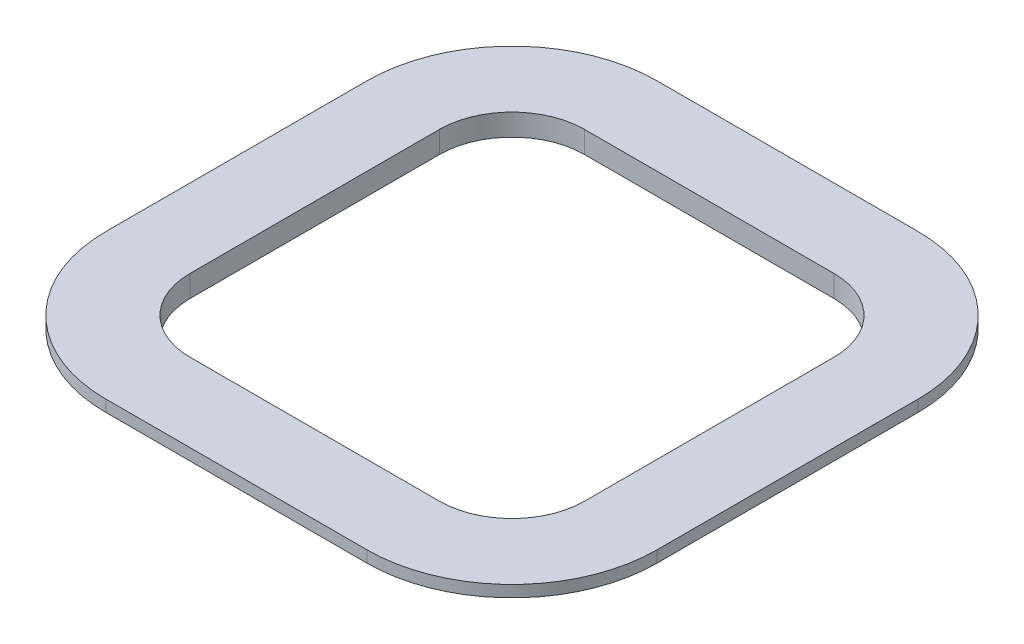
ISO-10303-21;
HEADER;
FILE_DESCRIPTION(('STEP AP214'),'2;1');
FILE_NAME('part.step','',(''),(''),'','','');
FILE_SCHEMA(('AUTOMOTIVE_DESIGN { 1 0 10303 214 1 1 1 1 }'));
ENDSEC;
DATA;
#1=APPLICATION_CONTEXT('core data for automotive mechanical design processes');
#2=APPLICATION_PROTOCOL_DEFINITION('international standard','automotive_design',2000,#1);
#3=PRODUCT_CONTEXT('',#1,'mechanical');
#4=PRODUCT('Part','Part','',(#3));
#5=PRODUCT_RELATED_PRODUCT_CATEGORY('part','',(#4));
#6=PRODUCT_DEFINITION_FORMATION('','',#4);
#7=PRODUCT_DEFINITION_CONTEXT('part definition',#1,'design');
#8=PRODUCT_DEFINITION('design','',#6,#7);
#9=PRODUCT_DEFINITION_SHAPE('','',#8);
#10=(LENGTH_UNIT() NAMED_UNIT(*) SI_UNIT(.MILLI.,.METRE.));
#11=(NAMED_UNIT(*) PLANE_ANGLE_UNIT() SI_UNIT($,.RADIAN.));
#12=(NAMED_UNIT(*) SI_UNIT($,.STERADIAN.) SOLID_ANGLE_UNIT());
#13=UNCERTAINTY_MEASURE_WITH_UNIT(LENGTH_MEASURE(1.E-05),#10,'distance_accuracy_value','');
#14=(GEOMETRIC_REPRESENTATION_CONTEXT(3) GLOBAL_UNCERTAINTY_ASSIGNED_CONTEXT((#13)) GLOBAL_UNIT_ASSIGNED_CONTEXT((#10,
#11,#12)) REPRESENTATION_CONTEXT('',''));
#15=CARTESIAN_POINT('',(0.,0.,0.));
#16=DIRECTION('',(0.,0.,1.));
#17=DIRECTION('',(1.,0.,0.));
#18=AXIS2_PLACEMENT_3D('',#15,#16,#17);
#19=CARTESIAN_POINT('',(-19.,-1.5,-19.));
#20=DIRECTION('',(-1.,0.,0.));
#21=DIRECTION('',(0.,0.,1.));
#22=AXIS2_PLACEMENT_3D('',#19,#20,#21);
#23=PLANE('',#22);
#24=DIRECTION('',(0.,1.,0.));
#25=VECTOR('',#24,1.);
#26=CARTESIAN_POINT('',(-19.,-1.5,-8.99999999999999));
#27=LINE('',#26,#25);
#28=CARTESIAN_POINT('',(-19.,0.,-8.99999999999999));
#29=VERTEX_POINT('',#28);
#30=CARTESIAN_POINT('',(-19.,-0.8,-8.99999999999999));
#31=VERTEX_POINT('',#30);
#32=EDGE_CURVE('E11',#29,#31,#27,.F.);
#33=ORIENTED_EDGE('',*,*,#32,.T.);
#34=DIRECTION('',(0.,0.,1.));
#35=VECTOR('',#34,1.);
#36=CARTESIAN_POINT('',(-19.,-0.8,-8.99999999999999));
#37=LINE('',#36,#35);
#38=CARTESIAN_POINT('',(-19.,-0.8,9.));
#39=VERTEX_POINT('',#38);
#40=EDGE_CURVE('E222',#31,#39,#37,.T.);
#41=ORIENTED_EDGE('',*,*,#40,.T.);
#42=DIRECTION('',(0.,1.,0.));
#43=VECTOR('',#42,1.);
#44=CARTESIAN_POINT('',(-19.,-1.5,9.00000000000001));
#45=LINE('',#44,#43);
#46=CARTESIAN_POINT('',(-19.,0.,9.00000000000001));
#47=VERTEX_POINT('',#46);
#48=EDGE_CURVE('E40',#39,#47,#45,.T.);
#49=ORIENTED_EDGE('',*,*,#48,.T.);
#50=DIRECTION('',(0.,0.,1.));
#51=VECTOR('',#50,1.);
#52=CARTESIAN_POINT('',(-19.,0.,-19.));
#53=LINE('',#52,#51);
#54=EDGE_CURVE('E265',#29,#47,#53,.T.);
#55=ORIENTED_EDGE('',*,*,#54,.F.);
#56=EDGE_LOOP('',(#33,#41,#49,#55));
#57=FACE_BOUND('',#56,.T.);
#58=ADVANCED_FACE('F32',(#57),#23,.T.);
#59=CARTESIAN_POINT('',(-19.,-1.5,-19.));
#60=DIRECTION('',(0.,0.,-1.));
#61=DIRECTION('',(-1.,0.,0.));
#62=AXIS2_PLACEMENT_3D('',#59,#60,#61);
#63=PLANE('',#62);
#64=DIRECTION('',(0.,1.,0.));
#65=VECTOR('',#64,1.);
#66=CARTESIAN_POINT('',(8.99999999999999,-1.5,-19.));
#67=LINE('',#66,#65);
#68=CARTESIAN_POINT('',(8.99999999999999,0.,-19.));
#69=VERTEX_POINT('',#68);
#70=CARTESIAN_POINT('',(8.99999999999999,-0.8,-19.));
#71=VERTEX_POINT('',#70);
#72=EDGE_CURVE('E348',#69,#71,#67,.F.);
#73=ORIENTED_EDGE('',*,*,#72,.T.);
#74=DIRECTION('',(-1.,0.,0.));
#75=VECTOR('',#74,1.);
#76=CARTESIAN_POINT('',(8.99999999999999,-0.8,-19.));
#77=LINE('',#76,#75);
#78=CARTESIAN_POINT('',(-9.00000000000001,-0.8,-19.));
#79=VERTEX_POINT('',#78);
#80=EDGE_CURVE('E206',#71,#79,#77,.T.);
#81=ORIENTED_EDGE('',*,*,#80,.T.);
#82=DIRECTION('',(0.,1.,0.));
#83=VECTOR('',#82,1.);
#84=CARTESIAN_POINT('',(-9.00000000000001,-1.5,-19.));
#85=LINE('',#84,#83);
#86=CARTESIAN_POINT('',(-9.00000000000001,0.,-19.));
#87=VERTEX_POINT('',#86);
#88=EDGE_CURVE('E55',#79,#87,#85,.T.);
#89=ORIENTED_EDGE('',*,*,#88,.T.);
#90=DIRECTION('',(-1.,0.,0.));
#91=VECTOR('',#90,1.);
#92=CARTESIAN_POINT('',(-19.,0.,-19.));
#93=LINE('',#92,#91);
#94=EDGE_CURVE('E284',#69,#87,#93,.T.);
#95=ORIENTED_EDGE('',*,*,#94,.F.);
#96=EDGE_LOOP('',(#73,#81,#89,#95));
#97=FACE_BOUND('',#96,.T.);
#98=ADVANCED_FACE('F370',(#97),#63,.T.);
#99=CARTESIAN_POINT('',(-19.,-1.5,19.));
#100=DIRECTION('',(0.,0.,1.));
#101=DIRECTION('',(1.,0.,0.));
#102=AXIS2_PLACEMENT_3D('',#99,#100,#101);
#103=PLANE('',#102);
#104=DIRECTION('',(0.,1.,0.));
#105=VECTOR('',#104,1.);
#106=CARTESIAN_POINT('',(-9.00000000000001,-1.5,19.));
#107=LINE('',#106,#105);
#108=CARTESIAN_POINT('',(-9.00000000000001,0.,19.));
#109=VERTEX_POINT('',#108);
#110=CARTESIAN_POINT('',(-9.00000000000001,-0.8,19.));
#111=VERTEX_POINT('',#110);
#112=EDGE_CURVE('E329',#109,#111,#107,.F.);
#113=ORIENTED_EDGE('',*,*,#112,.T.);
#114=DIRECTION('',(1.,0.,0.));
#115=VECTOR('',#114,1.);
#116=CARTESIAN_POINT('',(-9.00000000000001,-0.8,19.));
#117=LINE('',#116,#115);
#118=CARTESIAN_POINT('',(9.,-0.8,19.));
#119=VERTEX_POINT('',#118);
#120=EDGE_CURVE('E237',#111,#119,#117,.T.);
#121=ORIENTED_EDGE('',*,*,#120,.T.);
#122=DIRECTION('',(0.,1.,0.));
#123=VECTOR('',#122,1.);
#124=CARTESIAN_POINT('',(9.,-1.5,19.));
#125=LINE('',#124,#123);
#126=CARTESIAN_POINT('',(9.,0.,19.));
#127=VERTEX_POINT('',#126);
#128=EDGE_CURVE('E332',#119,#127,#125,.T.);
#129=ORIENTED_EDGE('',*,*,#128,.T.);
#130=DIRECTION('',(1.,0.,0.));
#131=VECTOR('',#130,1.);
#132=CARTESIAN_POINT('',(-19.,0.,19.));
#133=LINE('',#132,#131);
#134=EDGE_CURVE('E278',#109,#127,#133,.T.);
#135=ORIENTED_EDGE('',*,*,#134,.F.);
#136=EDGE_LOOP('',(#113,#121,#129,#135));
#137=FACE_BOUND('',#136,.T.);
#138=ADVANCED_FACE('F390',(#137),#103,.T.);
#139=CARTESIAN_POINT('',(-19.,-1.5,19.));
#140=DIRECTION('',(0.,1.,0.));
#141=DIRECTION('',(0.,0.,1.));
#142=AXIS2_PLACEMENT_3D('',#139,#140,#141);
#143=PLANE('',#142);
#144=DIRECTION('',(1.,0.,0.));
#145=VECTOR('',#144,1.);
#146=CARTESIAN_POINT('',(-9.00000000000001,-1.5,13.6));
#147=LINE('',#146,#145);
#148=CARTESIAN_POINT('',(-9.00000000000001,-1.5,13.6));
#149=VERTEX_POINT('',#148);
#150=CARTESIAN_POINT('',(-8.6,-1.5,13.6));
#151=VERTEX_POINT('',#150);
#152=EDGE_CURVE('E235',#149,#151,#147,.T.);
#153=ORIENTED_EDGE('',*,*,#152,.F.);
#154=CARTESIAN_POINT('',(-9.00000000000001,-1.5,9.00000000000001));
#155=DIRECTION('',(0.,1.,0.));
#156=DIRECTION('',(0.,0.,1.));
#157=AXIS2_PLACEMENT_3D('',#154,#155,#156);
#158=CIRCLE('',#157,4.6);
#159=CARTESIAN_POINT('',(-13.6,-1.5,9.));
#160=VERTEX_POINT('',#159);
#161=EDGE_CURVE('E226',#160,#149,#158,.T.);
#162=ORIENTED_EDGE('',*,*,#161,.F.);
#163=DIRECTION('',(0.,0.,1.));
#164=VECTOR('',#163,1.);
#165=CARTESIAN_POINT('',(-13.6,-1.5,-9.));
#166=LINE('',#165,#164);
#167=CARTESIAN_POINT('',(-13.6,-1.5,8.6));
#168=VERTEX_POINT('',#167);
#169=EDGE_CURVE('E219',#168,#160,#166,.T.);
#170=ORIENTED_EDGE('',*,*,#169,.F.);
#171=CARTESIAN_POINT('',(-8.6,-1.5,8.6));
#172=DIRECTION('',(0.,1.,0.));
#173=DIRECTION('',(0.,0.,1.));
#174=AXIS2_PLACEMENT_3D('',#171,#172,#173);
#175=CIRCLE('',#174,5.);
#176=EDGE_CURVE('E317',#168,#151,#175,.T.);
#177=ORIENTED_EDGE('',*,*,#176,.T.);
#178=EDGE_LOOP('',(#153,#162,#170,#177));
#179=FACE_BOUND('',#178,.T.);
#180=ADVANCED_FACE('F402',(#179),#143,.F.);
#181=CARTESIAN_POINT('',(-13.6,-1.5,-9.));
#182=VERTEX_POINT('',#181);
#183=CARTESIAN_POINT('',(-13.6,-1.5,-8.6));
#184=VERTEX_POINT('',#183);
#185=EDGE_CURVE('E220',#182,#184,#166,.T.);
#186=ORIENTED_EDGE('',*,*,#185,.F.);
#187=CARTESIAN_POINT('',(-9.00000000000001,-1.5,-8.99999999999999));
#188=DIRECTION('',(0.,1.,0.));
#189=DIRECTION('',(0.,0.,1.));
#190=AXIS2_PLACEMENT_3D('',#187,#188,#189);
#191=CIRCLE('',#190,4.6);
#192=CARTESIAN_POINT('',(-9.,-1.5,-13.6));
#193=VERTEX_POINT('',#192);
#194=EDGE_CURVE('E210',#193,#182,#191,.T.);
#195=ORIENTED_EDGE('',*,*,#194,.F.);
#196=DIRECTION('',(-1.,0.,0.));
#197=VECTOR('',#196,1.);
#198=CARTESIAN_POINT('',(8.99999999999999,-1.5,-13.6));
#199=LINE('',#198,#197);
#200=CARTESIAN_POINT('',(-8.6,-1.5,-13.6));
#201=VERTEX_POINT('',#200);
#202=EDGE_CURVE('E204',#201,#193,#199,.T.);
#203=ORIENTED_EDGE('',*,*,#202,.F.);
#204=CARTESIAN_POINT('',(-8.6,-1.5,-8.6));
#205=DIRECTION('',(0.,1.,0.));
#206=DIRECTION('',(0.,0.,1.));
#207=AXIS2_PLACEMENT_3D('',#204,#205,#206);
#208=CIRCLE('',#207,5.);
#209=EDGE_CURVE('E322',#201,#184,#208,.T.);
#210=ORIENTED_EDGE('',*,*,#209,.T.);
#211=EDGE_LOOP('',(#186,#195,#203,#210));
#212=FACE_BOUND('',#211,.T.);
#213=ADVANCED_FACE('F438',(#212),#143,.F.);
#214=CARTESIAN_POINT('',(8.99999999999999,-1.5,-13.6));
#215=VERTEX_POINT('',#214);
#216=CARTESIAN_POINT('',(8.6,-1.5,-13.6));
#217=VERTEX_POINT('',#216);
#218=EDGE_CURVE('E195',#215,#217,#199,.T.);
#219=ORIENTED_EDGE('',*,*,#218,.F.);
#220=CARTESIAN_POINT('',(8.99999999999999,-1.5,-8.99999999999999));
#221=DIRECTION('',(0.,1.,0.));
#222=DIRECTION('',(0.,0.,1.));
#223=AXIS2_PLACEMENT_3D('',#220,#221,#222);
#224=CIRCLE('',#223,4.60000000000001);
#225=CARTESIAN_POINT('',(13.6,-1.5,-8.99999999999999));
#226=VERTEX_POINT('',#225);
#227=EDGE_CURVE('E189',#226,#215,#224,.T.);
#228=ORIENTED_EDGE('',*,*,#227,.F.);
#229=DIRECTION('',(0.,0.,1.));
#230=VECTOR('',#229,1.);
#231=CARTESIAN_POINT('',(13.6,-1.5,-8.99999999999999));
#232=LINE('',#231,#230);
#233=CARTESIAN_POINT('',(13.6,-1.5,-8.6));
#234=VERTEX_POINT('',#233);
#235=EDGE_CURVE('E171',#226,#234,#232,.T.);
#236=ORIENTED_EDGE('',*,*,#235,.T.);
#237=CARTESIAN_POINT('',(8.6,-1.5,-8.6));
#238=DIRECTION('',(0.,1.,0.));
#239=DIRECTION('',(0.,0.,1.));
#240=AXIS2_PLACEMENT_3D('',#237,#238,#239);
#241=CIRCLE('',#240,5.);
#242=EDGE_CURVE('E327',#234,#217,#241,.T.);
#243=ORIENTED_EDGE('',*,*,#242,.T.);
#244=EDGE_LOOP('',(#219,#228,#236,#243));
#245=FACE_BOUND('',#244,.T.);
#246=ADVANCED_FACE('F194',(#245),#143,.F.);
#247=CARTESIAN_POINT('',(8.6,-1.5,13.6));
#248=VERTEX_POINT('',#247);
#249=CARTESIAN_POINT('',(8.99999999999999,-1.5,13.6));
#250=VERTEX_POINT('',#249);
#251=EDGE_CURVE('E234',#248,#250,#147,.T.);
#252=ORIENTED_EDGE('',*,*,#251,.F.);
#253=CARTESIAN_POINT('',(8.6,-1.5,8.6));
#254=DIRECTION('',(0.,1.,0.));
#255=DIRECTION('',(0.,0.,1.));
#256=AXIS2_PLACEMENT_3D('',#253,#254,#255);
#257=CIRCLE('',#256,5.);
#258=CARTESIAN_POINT('',(13.6,-1.5,8.6));
#259=VERTEX_POINT('',#258);
#260=EDGE_CURVE('E312',#248,#259,#257,.T.);
#261=ORIENTED_EDGE('',*,*,#260,.T.);
#262=CARTESIAN_POINT('',(13.6,-1.5,9.00000000000001));
#263=VERTEX_POINT('',#262);
#264=EDGE_CURVE('E183',#259,#263,#232,.T.);
#265=ORIENTED_EDGE('',*,*,#264,.T.);
#266=CARTESIAN_POINT('',(9.,-1.5,9.));
#267=DIRECTION('',(0.,1.,0.));
#268=DIRECTION('',(0.,0.,1.));
#269=AXIS2_PLACEMENT_3D('',#266,#267,#268);
#270=CIRCLE('',#269,4.6);
#271=EDGE_CURVE('E242',#250,#263,#270,.T.);
#272=ORIENTED_EDGE('',*,*,#271,.F.);
#273=EDGE_LOOP('',(#252,#261,#265,#272));
#274=FACE_BOUND('',#273,.T.);
#275=ADVANCED_FACE('F473',(#274),#143,.F.);
#276=CARTESIAN_POINT('',(9.,-1.5,9.));
#277=DIRECTION('',(0.,1.,0.));
#278=DIRECTION('',(0.,0.,1.));
#279=AXIS2_PLACEMENT_3D('',#276,#277,#278);
#280=CYLINDRICAL_SURFACE('',#279,10.);
#281=ORIENTED_EDGE('',*,*,#128,.F.);
#282=CARTESIAN_POINT('',(9.,-0.8,9.));
#283=DIRECTION('',(0.,1.,0.));
#284=DIRECTION('',(0.,0.,1.));
#285=AXIS2_PLACEMENT_3D('',#282,#283,#284);
#286=CIRCLE('',#285,10.);
#287=CARTESIAN_POINT('',(19.,-0.8,9.));
#288=VERTEX_POINT('',#287);
#289=EDGE_CURVE('E245',#119,#288,#286,.T.);
#290=ORIENTED_EDGE('',*,*,#289,.T.);
#291=DIRECTION('',(0.,1.,0.));
#292=VECTOR('',#291,1.);
#293=CARTESIAN_POINT('',(19.,-1.5,9.));
#294=LINE('',#293,#292);
#295=CARTESIAN_POINT('',(19.,0.,9.));
#296=VERTEX_POINT('',#295);
#297=EDGE_CURVE('E344',#296,#288,#294,.F.);
#298=ORIENTED_EDGE('',*,*,#297,.F.);
#299=CARTESIAN_POINT('',(9.,0.,9.));
#300=DIRECTION('',(0.,1.,0.));
#301=DIRECTION('',(0.,0.,1.));
#302=AXIS2_PLACEMENT_3D('',#299,#300,#301);
#303=CIRCLE('',#302,10.);
#304=EDGE_CURVE('E340',#127,#296,#303,.T.);
#305=ORIENTED_EDGE('',*,*,#304,.F.);
#306=EDGE_LOOP('',(#281,#290,#298,#305));
#307=FACE_BOUND('',#306,.T.);
#308=ADVANCED_FACE('F387',(#307),#280,.T.);
#309=CARTESIAN_POINT('',(8.99999999999999,-1.5,-8.99999999999999));
#310=DIRECTION('',(0.,1.,0.));
#311=DIRECTION('',(0.,0.,1.));
#312=AXIS2_PLACEMENT_3D('',#309,#310,#311);
#313=CYLINDRICAL_SURFACE('',#312,10.);
#314=DIRECTION('',(0.,1.,0.));
#315=VECTOR('',#314,1.);
#316=CARTESIAN_POINT('',(19.,-1.5,-9.));
#317=LINE('',#316,#315);
#318=CARTESIAN_POINT('',(19.,-0.8,-8.99999999999999));
#319=VERTEX_POINT('',#318);
#320=CARTESIAN_POINT('',(19.,0.,-9.));
#321=VERTEX_POINT('',#320);
#322=EDGE_CURVE('E342',#319,#321,#317,.T.);
#323=ORIENTED_EDGE('',*,*,#322,.F.);
#324=CARTESIAN_POINT('',(8.99999999999999,-0.8,-8.99999999999999));
#325=DIRECTION('',(0.,1.,0.));
#326=DIRECTION('',(0.,0.,1.));
#327=AXIS2_PLACEMENT_3D('',#324,#325,#326);
#328=CIRCLE('',#327,10.);
#329=EDGE_CURVE('E192',#319,#71,#328,.T.);
#330=ORIENTED_EDGE('',*,*,#329,.T.);
#331=ORIENTED_EDGE('',*,*,#72,.F.);
#332=CARTESIAN_POINT('',(8.99999999999999,0.,-8.99999999999999));
#333=DIRECTION('',(0.,1.,0.));
#334=DIRECTION('',(0.,0.,1.));
#335=AXIS2_PLACEMENT_3D('',#332,#333,#334);
#336=CIRCLE('',#335,10.);
#337=EDGE_CURVE('E338',#321,#69,#336,.T.);
#338=ORIENTED_EDGE('',*,*,#337,.F.);
#339=EDGE_LOOP('',(#323,#330,#331,#338));
#340=FACE_BOUND('',#339,.T.);
#341=ADVANCED_FACE('F375',(#340),#313,.T.);
#342=CARTESIAN_POINT('',(-9.00000000000001,-1.5,-8.99999999999999));
#343=DIRECTION('',(0.,1.,0.));
#344=DIRECTION('',(0.,0.,1.));
#345=AXIS2_PLACEMENT_3D('',#342,#343,#344);
#346=CYLINDRICAL_SURFACE('',#345,10.);
#347=ORIENTED_EDGE('',*,*,#88,.F.);
#348=CARTESIAN_POINT('',(-9.00000000000001,-0.8,-8.99999999999999));
#349=DIRECTION('',(0.,1.,0.));
#350=DIRECTION('',(0.,0.,1.));
#351=AXIS2_PLACEMENT_3D('',#348,#349,#350);
#352=CIRCLE('',#351,9.99999999999999);
#353=EDGE_CURVE('E213',#79,#31,#352,.T.);
#354=ORIENTED_EDGE('',*,*,#353,.T.);
#355=ORIENTED_EDGE('',*,*,#32,.F.);
#356=CARTESIAN_POINT('',(-9.00000000000001,0.,-8.99999999999999));
#357=DIRECTION('',(0.,1.,0.));
#358=DIRECTION('',(0.,0.,1.));
#359=AXIS2_PLACEMENT_3D('',#356,#357,#358);
#360=CIRCLE('',#359,10.);
#361=EDGE_CURVE('E336',#87,#29,#360,.T.);
#362=ORIENTED_EDGE('',*,*,#361,.F.);
#363=EDGE_LOOP('',(#347,#354,#355,#362));
#364=FACE_BOUND('',#363,.T.);
#365=ADVANCED_FACE('F361',(#364),#346,.T.);
#366=CARTESIAN_POINT('',(-9.00000000000001,-1.5,9.00000000000001));
#367=DIRECTION('',(0.,1.,0.));
#368=DIRECTION('',(0.,0.,1.));
#369=AXIS2_PLACEMENT_3D('',#366,#367,#368);
#370=CYLINDRICAL_SURFACE('',#369,10.);
#371=ORIENTED_EDGE('',*,*,#48,.F.);
#372=CARTESIAN_POINT('',(-9.00000000000001,-0.8,9.00000000000001));
#373=DIRECTION('',(0.,1.,0.));
#374=DIRECTION('',(0.,0.,1.));
#375=AXIS2_PLACEMENT_3D('',#372,#373,#374);
#376=CIRCLE('',#375,10.);
#377=EDGE_CURVE('E228',#39,#111,#376,.T.);
#378=ORIENTED_EDGE('',*,*,#377,.T.);
#379=ORIENTED_EDGE('',*,*,#112,.F.);
#380=CARTESIAN_POINT('',(-9.00000000000001,0.,9.00000000000001));
#381=DIRECTION('',(0.,1.,0.));
#382=DIRECTION('',(0.,0.,1.));
#383=AXIS2_PLACEMENT_3D('',#380,#381,#382);
#384=CIRCLE('',#383,10.);
#385=EDGE_CURVE('E334',#47,#109,#384,.T.);
#386=ORIENTED_EDGE('',*,*,#385,.F.);
#387=EDGE_LOOP('',(#371,#378,#379,#386));
#388=FACE_BOUND('',#387,.T.);
#389=ADVANCED_FACE('F34',(#388),#370,.T.);
#390=CARTESIAN_POINT('',(19.,-1.5,-19.));
#391=DIRECTION('',(1.,0.,0.));
#392=DIRECTION('',(0.,0.,-1.));
#393=AXIS2_PLACEMENT_3D('',#390,#391,#392);
#394=PLANE('',#393);
#395=DIRECTION('',(0.,0.,1.));
#396=VECTOR('',#395,1.);
#397=CARTESIAN_POINT('',(19.,-0.8,-8.99999999999999));
#398=LINE('',#397,#396);
#399=EDGE_CURVE('E182',#319,#288,#398,.T.);
#400=ORIENTED_EDGE('',*,*,#399,.F.);
#401=ORIENTED_EDGE('',*,*,#322,.T.);
#402=DIRECTION('',(0.,0.,-1.));
#403=VECTOR('',#402,1.);
#404=CARTESIAN_POINT('',(19.,0.,-19.));
#405=LINE('',#404,#403);
#406=EDGE_CURVE('E281',#296,#321,#405,.T.);
#407=ORIENTED_EDGE('',*,*,#406,.F.);
#408=ORIENTED_EDGE('',*,*,#297,.T.);
#409=EDGE_LOOP('',(#400,#401,#407,#408));
#410=FACE_BOUND('',#409,.T.);
#411=ADVANCED_FACE('F378',(#410),#394,.T.);
#412=CARTESIAN_POINT('',(-19.,0.,19.));
#413=DIRECTION('',(0.,1.,0.));
#414=DIRECTION('',(0.,0.,1.));
#415=AXIS2_PLACEMENT_3D('',#412,#413,#414);
#416=PLANE('',#415);
#417=DIRECTION('',(0.,0.,1.));
#418=VECTOR('',#417,1.);
#419=CARTESIAN_POINT('',(-13.6,0.,-13.6));
#420=LINE('',#419,#418);
#421=CARTESIAN_POINT('',(-13.6,0.,-8.59999999999999));
#422=VERTEX_POINT('',#421);
#423=CARTESIAN_POINT('',(-13.6,0.,8.6));
#424=VERTEX_POINT('',#423);
#425=EDGE_CURVE('E248',#422,#424,#420,.T.);
#426=ORIENTED_EDGE('',*,*,#425,.F.);
#427=CARTESIAN_POINT('',(-8.6,0.,-8.6));
#428=DIRECTION('',(0.,1.,0.));
#429=DIRECTION('',(0.,0.,1.));
#430=AXIS2_PLACEMENT_3D('',#427,#428,#429);
#431=CIRCLE('',#430,5.);
#432=CARTESIAN_POINT('',(-8.6,0.,-13.6));
#433=VERTEX_POINT('',#432);
#434=EDGE_CURVE('E320',#422,#433,#431,.F.);
#435=ORIENTED_EDGE('',*,*,#434,.T.);
#436=DIRECTION('',(-1.,0.,0.));
#437=VECTOR('',#436,1.);
#438=CARTESIAN_POINT('',(-13.6,0.,-13.6));
#439=LINE('',#438,#437);
#440=CARTESIAN_POINT('',(8.6,0.,-13.6));
#441=VERTEX_POINT('',#440);
#442=EDGE_CURVE('E260',#441,#433,#439,.T.);
#443=ORIENTED_EDGE('',*,*,#442,.F.);
#444=CARTESIAN_POINT('',(8.6,0.,-8.6));
#445=DIRECTION('',(0.,1.,0.));
#446=DIRECTION('',(0.,0.,1.));
#447=AXIS2_PLACEMENT_3D('',#444,#445,#446);
#448=CIRCLE('',#447,5.);
#449=CARTESIAN_POINT('',(13.6,0.,-8.6));
#450=VERTEX_POINT('',#449);
#451=EDGE_CURVE('E325',#441,#450,#448,.F.);
#452=ORIENTED_EDGE('',*,*,#451,.T.);
#453=DIRECTION('',(0.,0.,-1.));
#454=VECTOR('',#453,1.);
#455=CARTESIAN_POINT('',(13.6,0.,-13.6));
#456=LINE('',#455,#454);
#457=CARTESIAN_POINT('',(13.6,0.,8.6));
#458=VERTEX_POINT('',#457);
#459=EDGE_CURVE('E271',#458,#450,#456,.T.);
#460=ORIENTED_EDGE('',*,*,#459,.F.);
#461=CARTESIAN_POINT('',(8.6,0.,8.6));
#462=DIRECTION('',(0.,1.,0.));
#463=DIRECTION('',(0.,0.,1.));
#464=AXIS2_PLACEMENT_3D('',#461,#462,#463);
#465=CIRCLE('',#464,5.);
#466=CARTESIAN_POINT('',(8.6,0.,13.6));
#467=VERTEX_POINT('',#466);
#468=EDGE_CURVE('E310',#458,#467,#465,.F.);
#469=ORIENTED_EDGE('',*,*,#468,.T.);
#470=DIRECTION('',(1.,0.,0.));
#471=VECTOR('',#470,1.);
#472=CARTESIAN_POINT('',(-13.6,0.,13.6));
#473=LINE('',#472,#471);
#474=CARTESIAN_POINT('',(-8.6,0.,13.6));
#475=VERTEX_POINT('',#474);
#476=EDGE_CURVE('E268',#475,#467,#473,.T.);
#477=ORIENTED_EDGE('',*,*,#476,.F.);
#478=CARTESIAN_POINT('',(-8.6,0.,8.6));
#479=DIRECTION('',(0.,1.,0.));
#480=DIRECTION('',(0.,0.,1.));
#481=AXIS2_PLACEMENT_3D('',#478,#479,#480);
#482=CIRCLE('',#481,5.);
#483=EDGE_CURVE('E315',#475,#424,#482,.F.);
#484=ORIENTED_EDGE('',*,*,#483,.T.);
#485=EDGE_LOOP('',(#426,#435,#443,#452,#460,#469,#477,#484));
#486=FACE_BOUND('',#485,.T.);
#487=ORIENTED_EDGE('',*,*,#134,.T.);
#488=ORIENTED_EDGE('',*,*,#304,.T.);
#489=ORIENTED_EDGE('',*,*,#406,.T.);
#490=ORIENTED_EDGE('',*,*,#337,.T.);
#491=ORIENTED_EDGE('',*,*,#94,.T.);
#492=ORIENTED_EDGE('',*,*,#361,.T.);
#493=ORIENTED_EDGE('',*,*,#54,.T.);
#494=ORIENTED_EDGE('',*,*,#385,.T.);
#495=EDGE_LOOP('',(#487,#488,#489,#490,#491,#492,#493,#494));
#496=FACE_BOUND('',#495,.T.);
#497=ADVANCED_FACE('F359',(#486,#496),#416,.T.);
#498=CARTESIAN_POINT('',(-13.6,-1.5,-13.6));
#499=DIRECTION('',(-1.,0.,0.));
#500=DIRECTION('',(0.,0.,1.));
#501=AXIS2_PLACEMENT_3D('',#498,#499,#500);
#502=PLANE('',#501);
#503=ORIENTED_EDGE('',*,*,#425,.T.);
#504=DIRECTION('',(0.,1.,0.));
#505=VECTOR('',#504,1.);
#506=CARTESIAN_POINT('',(-13.6,-1.5,8.6));
#507=LINE('',#506,#505);
#508=EDGE_CURVE('E301',#424,#168,#507,.F.);
#509=ORIENTED_EDGE('',*,*,#508,.T.);
#510=DIRECTION('',(0.,0.,1.));
#511=VECTOR('',#510,1.);
#512=CARTESIAN_POINT('',(-13.6,-1.5,-13.6));
#513=LINE('',#512,#511);
#514=EDGE_CURVE('E257',#184,#168,#513,.T.);
#515=ORIENTED_EDGE('',*,*,#514,.F.);
#516=DIRECTION('',(0.,1.,0.));
#517=VECTOR('',#516,1.);
#518=CARTESIAN_POINT('',(-13.6,0.,-8.59999999999999));
#519=LINE('',#518,#517);
#520=EDGE_CURVE('E298',#184,#422,#519,.T.);
#521=ORIENTED_EDGE('',*,*,#520,.T.);
#522=EDGE_LOOP('',(#503,#509,#515,#521));
#523=FACE_BOUND('',#522,.T.);
#524=ADVANCED_FACE('F407',(#523),#502,.F.);
#525=CARTESIAN_POINT('',(-13.6,-1.5,-13.6));
#526=DIRECTION('',(0.,0.,-1.));
#527=DIRECTION('',(-1.,0.,0.));
#528=AXIS2_PLACEMENT_3D('',#525,#526,#527);
#529=PLANE('',#528);
#530=ORIENTED_EDGE('',*,*,#442,.T.);
#531=DIRECTION('',(0.,1.,0.));
#532=VECTOR('',#531,1.);
#533=CARTESIAN_POINT('',(-8.6,-1.5,-13.6));
#534=LINE('',#533,#532);
#535=EDGE_CURVE('E307',#433,#201,#534,.F.);
#536=ORIENTED_EDGE('',*,*,#535,.T.);
#537=DIRECTION('',(-1.,0.,0.));
#538=VECTOR('',#537,1.);
#539=CARTESIAN_POINT('',(-13.6,-1.5,-13.6));
#540=LINE('',#539,#538);
#541=EDGE_CURVE('E263',#217,#201,#540,.T.);
#542=ORIENTED_EDGE('',*,*,#541,.F.);
#543=DIRECTION('',(0.,1.,0.));
#544=VECTOR('',#543,1.);
#545=CARTESIAN_POINT('',(8.6,0.,-13.6));
#546=LINE('',#545,#544);
#547=EDGE_CURVE('E304',#217,#441,#546,.T.);
#548=ORIENTED_EDGE('',*,*,#547,.T.);
#549=EDGE_LOOP('',(#530,#536,#542,#548));
#550=FACE_BOUND('',#549,.T.);
#551=ADVANCED_FACE('F432',(#550),#529,.F.);
#552=CARTESIAN_POINT('',(13.6,-1.5,-13.6));
#553=DIRECTION('',(1.,0.,0.));
#554=DIRECTION('',(0.,0.,-1.));
#555=AXIS2_PLACEMENT_3D('',#552,#553,#554);
#556=PLANE('',#555);
#557=DIRECTION('',(0.,0.,-1.));
#558=VECTOR('',#557,1.);
#559=CARTESIAN_POINT('',(13.6,-1.5,-13.6));
#560=LINE('',#559,#558);
#561=EDGE_CURVE('E177',#259,#234,#560,.T.);
#562=ORIENTED_EDGE('',*,*,#561,.F.);
#563=DIRECTION('',(0.,1.,0.));
#564=VECTOR('',#563,1.);
#565=CARTESIAN_POINT('',(13.6,0.,8.6));
#566=LINE('',#565,#564);
#567=EDGE_CURVE('E289',#259,#458,#566,.T.);
#568=ORIENTED_EDGE('',*,*,#567,.T.);
#569=ORIENTED_EDGE('',*,*,#459,.T.);
#570=DIRECTION('',(0.,1.,0.));
#571=VECTOR('',#570,1.);
#572=CARTESIAN_POINT('',(13.6,-1.5,-8.6));
#573=LINE('',#572,#571);
#574=EDGE_CURVE('E287',#450,#234,#573,.F.);
#575=ORIENTED_EDGE('',*,*,#574,.T.);
#576=EDGE_LOOP('',(#562,#568,#569,#575));
#577=FACE_BOUND('',#576,.T.);
#578=ADVANCED_FACE('F424',(#577),#556,.F.);
#579=CARTESIAN_POINT('',(-13.6,-1.5,13.6));
#580=DIRECTION('',(0.,0.,1.));
#581=DIRECTION('',(1.,0.,0.));
#582=AXIS2_PLACEMENT_3D('',#579,#580,#581);
#583=PLANE('',#582);
#584=ORIENTED_EDGE('',*,*,#476,.T.);
#585=DIRECTION('',(0.,1.,0.));
#586=VECTOR('',#585,1.);
#587=CARTESIAN_POINT('',(8.6,-1.5,13.6));
#588=LINE('',#587,#586);
#589=EDGE_CURVE('E295',#467,#248,#588,.F.);
#590=ORIENTED_EDGE('',*,*,#589,.T.);
#591=DIRECTION('',(1.,0.,0.));
#592=VECTOR('',#591,1.);
#593=CARTESIAN_POINT('',(-13.6,-1.5,13.6));
#594=LINE('',#593,#592);
#595=EDGE_CURVE('E259',#151,#248,#594,.T.);
#596=ORIENTED_EDGE('',*,*,#595,.F.);
#597=DIRECTION('',(0.,1.,0.));
#598=VECTOR('',#597,1.);
#599=CARTESIAN_POINT('',(-8.6,0.,13.6));
#600=LINE('',#599,#598);
#601=EDGE_CURVE('E292',#151,#475,#600,.T.);
#602=ORIENTED_EDGE('',*,*,#601,.T.);
#603=EDGE_LOOP('',(#584,#590,#596,#602));
#604=FACE_BOUND('',#603,.T.);
#605=ADVANCED_FACE('F415',(#604),#583,.F.);
#606=CARTESIAN_POINT('',(8.6,-1.5,8.6));
#607=DIRECTION('',(0.,-1.,0.));
#608=DIRECTION('',(0.,0.,-1.));
#609=AXIS2_PLACEMENT_3D('',#606,#607,#608);
#610=CYLINDRICAL_SURFACE('',#609,5.);
#611=ORIENTED_EDGE('',*,*,#260,.F.);
#612=ORIENTED_EDGE('',*,*,#589,.F.);
#613=ORIENTED_EDGE('',*,*,#468,.F.);
#614=ORIENTED_EDGE('',*,*,#567,.F.);
#615=EDGE_LOOP('',(#611,#612,#613,#614));
#616=FACE_BOUND('',#615,.T.);
#617=ADVANCED_FACE('F422',(#616),#610,.F.);
#618=CARTESIAN_POINT('',(-8.6,-1.5,8.6));
#619=DIRECTION('',(0.,-1.,0.));
#620=DIRECTION('',(0.,0.,-1.));
#621=AXIS2_PLACEMENT_3D('',#618,#619,#620);
#622=CYLINDRICAL_SURFACE('',#621,5.);
#623=ORIENTED_EDGE('',*,*,#176,.F.);
#624=ORIENTED_EDGE('',*,*,#508,.F.);
#625=ORIENTED_EDGE('',*,*,#483,.F.);
#626=ORIENTED_EDGE('',*,*,#601,.F.);
#627=EDGE_LOOP('',(#623,#624,#625,#626));
#628=FACE_BOUND('',#627,.T.);
#629=ADVANCED_FACE('F412',(#628),#622,.F.);
#630=CARTESIAN_POINT('',(-8.6,-1.5,-8.6));
#631=DIRECTION('',(0.,-1.,0.));
#632=DIRECTION('',(0.,0.,-1.));
#633=AXIS2_PLACEMENT_3D('',#630,#631,#632);
#634=CYLINDRICAL_SURFACE('',#633,5.);
#635=ORIENTED_EDGE('',*,*,#209,.F.);
#636=ORIENTED_EDGE('',*,*,#535,.F.);
#637=ORIENTED_EDGE('',*,*,#434,.F.);
#638=ORIENTED_EDGE('',*,*,#520,.F.);
#639=EDGE_LOOP('',(#635,#636,#637,#638));
#640=FACE_BOUND('',#639,.T.);
#641=ADVANCED_FACE('F440',(#640),#634,.F.);
#642=CARTESIAN_POINT('',(8.6,-1.5,-8.6));
#643=DIRECTION('',(0.,-1.,0.));
#644=DIRECTION('',(0.,0.,-1.));
#645=AXIS2_PLACEMENT_3D('',#642,#643,#644);
#646=CYLINDRICAL_SURFACE('',#645,5.);
#647=ORIENTED_EDGE('',*,*,#242,.F.);
#648=ORIENTED_EDGE('',*,*,#574,.F.);
#649=ORIENTED_EDGE('',*,*,#451,.F.);
#650=ORIENTED_EDGE('',*,*,#547,.F.);
#651=EDGE_LOOP('',(#647,#648,#649,#650));
#652=FACE_BOUND('',#651,.T.);
#653=ADVANCED_FACE('F429',(#652),#646,.F.);
#654=CARTESIAN_POINT('',(9.,-0.8,9.));
#655=DIRECTION('',(0.,1.,0.));
#656=DIRECTION('',(0.,0.,1.));
#657=AXIS2_PLACEMENT_3D('',#654,#655,#656);
#658=CONICAL_SURFACE('',#657,10.,1.44188555511091);
#659=DIRECTION('',(0.,-0.128554028641395,-0.991702506662188));
#660=VECTOR('',#659,1.);
#661=CARTESIAN_POINT('',(8.99999999999999,-1.5,13.6));
#662=LINE('',#661,#660);
#663=EDGE_CURVE('E231',#119,#250,#662,.T.);
#664=ORIENTED_EDGE('',*,*,#663,.T.);
#665=ORIENTED_EDGE('',*,*,#271,.T.);
#666=DIRECTION('',(-0.991702506662188,-0.128554028641395,0.));
#667=VECTOR('',#666,1.);
#668=CARTESIAN_POINT('',(13.6,-1.5,9.00000000000001));
#669=LINE('',#668,#667);
#670=EDGE_CURVE('E240',#288,#263,#669,.T.);
#671=ORIENTED_EDGE('',*,*,#670,.F.);
#672=ORIENTED_EDGE('',*,*,#289,.F.);
#673=EDGE_LOOP('',(#664,#665,#671,#672));
#674=FACE_BOUND('',#673,.T.);
#675=ADVANCED_FACE('F382',(#674),#658,.T.);
#676=CARTESIAN_POINT('',(-9.00000000000001,-1.5,13.6));
#677=DIRECTION('',(0.,-0.991702506662188,0.128554028641395));
#678=DIRECTION('',(0.,-0.128554028641395,-0.991702506662188));
#679=AXIS2_PLACEMENT_3D('',#676,#677,#678);
#680=PLANE('',#679);
#681=DIRECTION('',(0.,-0.128554028641395,-0.991702506662188));
#682=VECTOR('',#681,1.);
#683=CARTESIAN_POINT('',(-9.00000000000001,-1.5,13.6));
#684=LINE('',#683,#682);
#685=EDGE_CURVE('E47',#111,#149,#684,.T.);
#686=ORIENTED_EDGE('',*,*,#685,.T.);
#687=ORIENTED_EDGE('',*,*,#152,.T.);
#688=ORIENTED_EDGE('',*,*,#595,.T.);
#689=ORIENTED_EDGE('',*,*,#251,.T.);
#690=ORIENTED_EDGE('',*,*,#663,.F.);
#691=ORIENTED_EDGE('',*,*,#120,.F.);
#692=EDGE_LOOP('',(#686,#687,#688,#689,#690,#691));
#693=FACE_BOUND('',#692,.T.);
#694=ADVANCED_FACE('F392',(#693),#680,.T.);
#695=CARTESIAN_POINT('',(-9.00000000000001,-0.8,9.00000000000001));
#696=DIRECTION('',(0.,1.,0.));
#697=DIRECTION('',(0.,0.,1.));
#698=AXIS2_PLACEMENT_3D('',#695,#696,#697);
#699=CONICAL_SURFACE('',#698,10.,1.44188555511091);
#700=DIRECTION('',(0.991702506662188,-0.128554028641395,0.));
#701=VECTOR('',#700,1.);
#702=CARTESIAN_POINT('',(-13.6,-1.5,9.));
#703=LINE('',#702,#701);
#704=EDGE_CURVE('E216',#39,#160,#703,.T.);
#705=ORIENTED_EDGE('',*,*,#704,.T.);
#706=ORIENTED_EDGE('',*,*,#161,.T.);
#707=ORIENTED_EDGE('',*,*,#685,.F.);
#708=ORIENTED_EDGE('',*,*,#377,.F.);
#709=EDGE_LOOP('',(#705,#706,#707,#708));
#710=FACE_BOUND('',#709,.T.);
#711=ADVANCED_FACE('F394',(#710),#699,.T.);
#712=CARTESIAN_POINT('',(-13.6,-1.5,-9.));
#713=DIRECTION('',(-0.128554028641395,-0.991702506662188,0.));
#714=DIRECTION('',(0.991702506662188,-0.128554028641395,0.));
#715=AXIS2_PLACEMENT_3D('',#712,#713,#714);
#716=PLANE('',#715);
#717=DIRECTION('',(0.991702506662188,-0.128554028641395,0.));
#718=VECTOR('',#717,1.);
#719=CARTESIAN_POINT('',(-13.6,-1.5,-9.));
#720=LINE('',#719,#718);
#721=EDGE_CURVE('E208',#31,#182,#720,.T.);
#722=ORIENTED_EDGE('',*,*,#721,.T.);
#723=ORIENTED_EDGE('',*,*,#185,.T.);
#724=ORIENTED_EDGE('',*,*,#514,.T.);
#725=ORIENTED_EDGE('',*,*,#169,.T.);
#726=ORIENTED_EDGE('',*,*,#704,.F.);
#727=ORIENTED_EDGE('',*,*,#40,.F.);
#728=EDGE_LOOP('',(#722,#723,#724,#725,#726,#727));
#729=FACE_BOUND('',#728,.T.);
#730=ADVANCED_FACE('F397',(#729),#716,.T.);
#731=CARTESIAN_POINT('',(-9.00000000000001,-0.8,-8.99999999999999));
#732=DIRECTION('',(0.,1.,0.));
#733=DIRECTION('',(0.,0.,1.));
#734=AXIS2_PLACEMENT_3D('',#731,#732,#733);
#735=CONICAL_SURFACE('',#734,9.99999999999999,1.4418855551109);
#736=DIRECTION('',(0.,-0.128554028641395,0.991702506662188));
#737=VECTOR('',#736,1.);
#738=CARTESIAN_POINT('',(-9.,-1.5,-13.6));
#739=LINE('',#738,#737);
#740=EDGE_CURVE('E198',#79,#193,#739,.T.);
#741=ORIENTED_EDGE('',*,*,#740,.T.);
#742=ORIENTED_EDGE('',*,*,#194,.T.);
#743=ORIENTED_EDGE('',*,*,#721,.F.);
#744=ORIENTED_EDGE('',*,*,#353,.F.);
#745=EDGE_LOOP('',(#741,#742,#743,#744));
#746=FACE_BOUND('',#745,.T.);
#747=ADVANCED_FACE('F365',(#746),#735,.T.);
#748=CARTESIAN_POINT('',(8.99999999999999,-1.5,-13.6));
#749=DIRECTION('',(0.,-0.991702506662188,-0.128554028641395));
#750=DIRECTION('',(0.,0.128554028641395,-0.991702506662188));
#751=AXIS2_PLACEMENT_3D('',#748,#749,#750);
#752=PLANE('',#751);
#753=DIRECTION('',(0.,-0.128554028641395,0.991702506662188));
#754=VECTOR('',#753,1.);
#755=CARTESIAN_POINT('',(8.99999999999999,-1.5,-13.6));
#756=LINE('',#755,#754);
#757=EDGE_CURVE('E196',#71,#215,#756,.T.);
#758=ORIENTED_EDGE('',*,*,#757,.T.);
#759=ORIENTED_EDGE('',*,*,#218,.T.);
#760=ORIENTED_EDGE('',*,*,#541,.T.);
#761=ORIENTED_EDGE('',*,*,#202,.T.);
#762=ORIENTED_EDGE('',*,*,#740,.F.);
#763=ORIENTED_EDGE('',*,*,#80,.F.);
#764=EDGE_LOOP('',(#758,#759,#760,#761,#762,#763));
#765=FACE_BOUND('',#764,.T.);
#766=ADVANCED_FACE('F368',(#765),#752,.T.);
#767=CARTESIAN_POINT('',(8.99999999999999,-0.8,-8.99999999999999));
#768=DIRECTION('',(0.,1.,0.));
#769=DIRECTION('',(0.,0.,1.));
#770=AXIS2_PLACEMENT_3D('',#767,#768,#769);
#771=CONICAL_SURFACE('',#770,10.,1.4418855551109);
#772=DIRECTION('',(-0.991702506662188,-0.128554028641395,0.));
#773=VECTOR('',#772,1.);
#774=CARTESIAN_POINT('',(13.6,-1.5,-8.99999999999999));
#775=LINE('',#774,#773);
#776=EDGE_CURVE('E174',#319,#226,#775,.T.);
#777=ORIENTED_EDGE('',*,*,#776,.T.);
#778=ORIENTED_EDGE('',*,*,#227,.T.);
#779=ORIENTED_EDGE('',*,*,#757,.F.);
#780=ORIENTED_EDGE('',*,*,#329,.F.);
#781=EDGE_LOOP('',(#777,#778,#779,#780));
#782=FACE_BOUND('',#781,.T.);
#783=ADVANCED_FACE('F187',(#782),#771,.T.);
#784=CARTESIAN_POINT('',(13.6,-1.5,-8.99999999999999));
#785=DIRECTION('',(-0.128554028641395,0.991702506662188,0.));
#786=DIRECTION('',(-0.991702506662188,-0.128554028641395,0.));
#787=AXIS2_PLACEMENT_3D('',#784,#785,#786);
#788=PLANE('',#787);
#789=ORIENTED_EDGE('',*,*,#235,.F.);
#790=ORIENTED_EDGE('',*,*,#776,.F.);
#791=ORIENTED_EDGE('',*,*,#399,.T.);
#792=ORIENTED_EDGE('',*,*,#670,.T.);
#793=ORIENTED_EDGE('',*,*,#264,.F.);
#794=ORIENTED_EDGE('',*,*,#561,.T.);
#795=EDGE_LOOP('',(#789,#790,#791,#792,#793,#794));
#796=FACE_BOUND('',#795,.T.);
#797=ADVANCED_FACE('F173',(#796),#788,.F.);
#798=CLOSED_SHELL('',(#58,#98,#138,#180,#213,#246,#275,#308,#341,#365,#389,#411,#497,#524,#551,
#578,#605,#617,#629,#641,#653,#675,#694,#711,#730,#747,#766,#783,#797));
#799=MANIFOLD_SOLID_BREP('B2',#798);
#800=ADVANCED_BREP_SHAPE_REPRESENTATION('',(#18,#799),#14);
#801=SHAPE_DEFINITION_REPRESENTATION(#9,#800);
ENDSEC;
END-ISO-10303-21;
